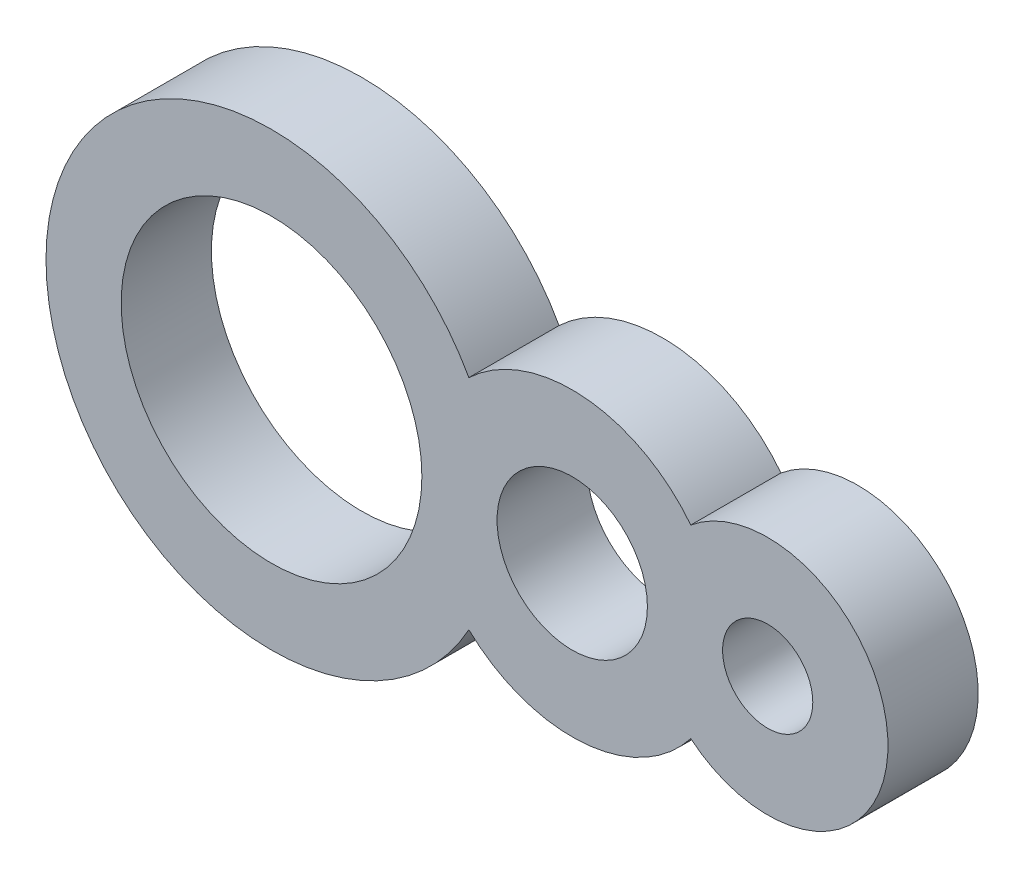
ISO-10303-21;
HEADER;
FILE_DESCRIPTION(('STEP AP214'),'2;1');
FILE_NAME('part.step','',(''),(''),'','','');
FILE_SCHEMA(('AUTOMOTIVE_DESIGN { 1 0 10303 214 1 1 1 1 }'));
ENDSEC;
DATA;
#1=APPLICATION_CONTEXT('core data for automotive mechanical design processes');
#2=APPLICATION_PROTOCOL_DEFINITION('international standard','automotive_design',2000,#1);
#3=PRODUCT_CONTEXT('',#1,'mechanical');
#4=PRODUCT('Part','Part','',(#3));
#5=PRODUCT_RELATED_PRODUCT_CATEGORY('part','',(#4));
#6=PRODUCT_DEFINITION_FORMATION('','',#4);
#7=PRODUCT_DEFINITION_CONTEXT('part definition',#1,'design');
#8=PRODUCT_DEFINITION('design','',#6,#7);
#9=PRODUCT_DEFINITION_SHAPE('','',#8);
#10=(LENGTH_UNIT() NAMED_UNIT(*) SI_UNIT(.MILLI.,.METRE.));
#11=(NAMED_UNIT(*) PLANE_ANGLE_UNIT() SI_UNIT($,.RADIAN.));
#12=(NAMED_UNIT(*) SI_UNIT($,.STERADIAN.) SOLID_ANGLE_UNIT());
#13=UNCERTAINTY_MEASURE_WITH_UNIT(LENGTH_MEASURE(1.E-05),#10,'distance_accuracy_value','');
#14=(GEOMETRIC_REPRESENTATION_CONTEXT(3) GLOBAL_UNCERTAINTY_ASSIGNED_CONTEXT((#13)) GLOBAL_UNIT_ASSIGNED_CONTEXT((#10,
#11,#12)) REPRESENTATION_CONTEXT('',''));
#15=CARTESIAN_POINT('',(0.,0.,0.));
#16=DIRECTION('',(0.,0.,1.));
#17=DIRECTION('',(1.,0.,0.));
#18=AXIS2_PLACEMENT_3D('',#15,#16,#17);
#19=CARTESIAN_POINT('',(13.25,0.,3.));
#20=DIRECTION('',(0.,0.,1.));
#21=DIRECTION('',(1.,0.,0.));
#22=AXIS2_PLACEMENT_3D('',#19,#20,#21);
#23=PLANE('',#22);
#24=CARTESIAN_POINT('',(10.,0.,3.));
#25=DIRECTION('',(0.,0.,1.));
#26=DIRECTION('',(1.,0.,0.));
#27=AXIS2_PLACEMENT_3D('',#24,#25,#26);
#28=CIRCLE('',#27,2.5);
#29=CARTESIAN_POINT('',(12.5,0.,3.));
#30=VERTEX_POINT('',#29);
#31=EDGE_CURVE('E134',#30,#30,#28,.T.);
#32=ORIENTED_EDGE('',*,*,#31,.F.);
#33=EDGE_LOOP('',(#32));
#34=FACE_BOUND('',#33,.T.);
#35=CARTESIAN_POINT('',(16.5,0.,3.));
#36=DIRECTION('',(0.,0.,1.));
#37=DIRECTION('',(1.,0.,0.));
#38=AXIS2_PLACEMENT_3D('',#35,#36,#37);
#39=CIRCLE('',#38,4.);
#40=CARTESIAN_POINT('',(13.9423076923077,-3.0754203060999,3.));
#41=VERTEX_POINT('',#40);
#42=CARTESIAN_POINT('',(13.9423076923077,3.0754203060999,3.));
#43=VERTEX_POINT('',#42);
#44=EDGE_CURVE('E92',#41,#43,#39,.T.);
#45=ORIENTED_EDGE('',*,*,#44,.T.);
#46=CARTESIAN_POINT('',(10.,0.,3.));
#47=DIRECTION('',(0.,0.,1.));
#48=DIRECTION('',(1.,0.,0.));
#49=AXIS2_PLACEMENT_3D('',#46,#47,#48);
#50=CIRCLE('',#49,5.);
#51=CARTESIAN_POINT('',(6.5625,3.63092188706945,3.));
#52=VERTEX_POINT('',#51);
#53=EDGE_CURVE('E87',#43,#52,#50,.T.);
#54=ORIENTED_EDGE('',*,*,#53,.T.);
#55=CARTESIAN_POINT('',(0.,0.,3.));
#56=DIRECTION('',(0.,0.,1.));
#57=DIRECTION('',(1.,0.,0.));
#58=AXIS2_PLACEMENT_3D('',#55,#56,#57);
#59=CIRCLE('',#58,7.5);
#60=CARTESIAN_POINT('',(6.5625,-3.63092188706945,3.));
#61=VERTEX_POINT('',#60);
#62=EDGE_CURVE('E90',#52,#61,#59,.T.);
#63=ORIENTED_EDGE('',*,*,#62,.T.);
#64=CARTESIAN_POINT('',(10.,0.,3.));
#65=DIRECTION('',(0.,0.,1.));
#66=DIRECTION('',(1.,0.,0.));
#67=AXIS2_PLACEMENT_3D('',#64,#65,#66);
#68=CIRCLE('',#67,5.);
#69=EDGE_CURVE('E57',#61,#41,#68,.T.);
#70=ORIENTED_EDGE('',*,*,#69,.T.);
#71=EDGE_LOOP('',(#45,#54,#63,#70));
#72=FACE_BOUND('',#71,.T.);
#73=CARTESIAN_POINT('',(0.,0.,3.));
#74=DIRECTION('',(0.,0.,1.));
#75=DIRECTION('',(1.,0.,0.));
#76=AXIS2_PLACEMENT_3D('',#73,#74,#75);
#77=CIRCLE('',#76,5.);
#78=CARTESIAN_POINT('',(5.,0.,3.));
#79=VERTEX_POINT('',#78);
#80=EDGE_CURVE('E112',#79,#79,#77,.T.);
#81=ORIENTED_EDGE('',*,*,#80,.F.);
#82=EDGE_LOOP('',(#81));
#83=FACE_BOUND('',#82,.T.);
#84=CARTESIAN_POINT('',(16.5,0.,3.));
#85=DIRECTION('',(0.,0.,1.));
#86=DIRECTION('',(1.,0.,0.));
#87=AXIS2_PLACEMENT_3D('',#84,#85,#86);
#88=CIRCLE('',#87,1.5);
#89=CARTESIAN_POINT('',(18.,0.,3.));
#90=VERTEX_POINT('',#89);
#91=EDGE_CURVE('E142',#90,#90,#88,.T.);
#92=ORIENTED_EDGE('',*,*,#91,.F.);
#93=EDGE_LOOP('',(#92));
#94=FACE_BOUND('',#93,.T.);
#95=ADVANCED_FACE('F39',(#34,#72,#83,#94),#23,.T.);
#96=CARTESIAN_POINT('',(13.25,0.,0.));
#97=DIRECTION('',(0.,0.,1.));
#98=DIRECTION('',(1.,0.,0.));
#99=AXIS2_PLACEMENT_3D('',#96,#97,#98);
#100=PLANE('',#99);
#101=CARTESIAN_POINT('',(16.5,0.,0.));
#102=DIRECTION('',(0.,0.,1.));
#103=DIRECTION('',(1.,0.,0.));
#104=AXIS2_PLACEMENT_3D('',#101,#102,#103);
#105=CIRCLE('',#104,4.);
#106=CARTESIAN_POINT('',(13.9423076923077,-3.0754203060999,0.));
#107=VERTEX_POINT('',#106);
#108=CARTESIAN_POINT('',(13.9423076923077,3.0754203060999,0.));
#109=VERTEX_POINT('',#108);
#110=EDGE_CURVE('E108',#107,#109,#105,.T.);
#111=ORIENTED_EDGE('',*,*,#110,.F.);
#112=CARTESIAN_POINT('',(10.,0.,0.));
#113=DIRECTION('',(0.,0.,1.));
#114=DIRECTION('',(1.,0.,0.));
#115=AXIS2_PLACEMENT_3D('',#112,#113,#114);
#116=CIRCLE('',#115,5.);
#117=CARTESIAN_POINT('',(6.5625,-3.63092188706945,0.));
#118=VERTEX_POINT('',#117);
#119=EDGE_CURVE('E80',#118,#107,#116,.T.);
#120=ORIENTED_EDGE('',*,*,#119,.F.);
#121=CARTESIAN_POINT('',(0.,0.,0.));
#122=DIRECTION('',(0.,0.,1.));
#123=DIRECTION('',(1.,0.,0.));
#124=AXIS2_PLACEMENT_3D('',#121,#122,#123);
#125=CIRCLE('',#124,7.5);
#126=CARTESIAN_POINT('',(6.5625,3.63092188706945,0.));
#127=VERTEX_POINT('',#126);
#128=EDGE_CURVE('E74',#127,#118,#125,.T.);
#129=ORIENTED_EDGE('',*,*,#128,.F.);
#130=CARTESIAN_POINT('',(10.,0.,0.));
#131=DIRECTION('',(0.,0.,1.));
#132=DIRECTION('',(1.,0.,0.));
#133=AXIS2_PLACEMENT_3D('',#130,#131,#132);
#134=CIRCLE('',#133,5.);
#135=EDGE_CURVE('E97',#109,#127,#134,.T.);
#136=ORIENTED_EDGE('',*,*,#135,.F.);
#137=EDGE_LOOP('',(#111,#120,#129,#136));
#138=FACE_BOUND('',#137,.T.);
#139=CARTESIAN_POINT('',(0.,0.,0.));
#140=DIRECTION('',(0.,0.,1.));
#141=DIRECTION('',(1.,0.,0.));
#142=AXIS2_PLACEMENT_3D('',#139,#140,#141);
#143=CIRCLE('',#142,5.);
#144=CARTESIAN_POINT('',(5.,0.,0.));
#145=VERTEX_POINT('',#144);
#146=EDGE_CURVE('E130',#145,#145,#143,.T.);
#147=ORIENTED_EDGE('',*,*,#146,.T.);
#148=EDGE_LOOP('',(#147));
#149=FACE_BOUND('',#148,.T.);
#150=CARTESIAN_POINT('',(10.,0.,0.));
#151=DIRECTION('',(0.,0.,1.));
#152=DIRECTION('',(1.,0.,0.));
#153=AXIS2_PLACEMENT_3D('',#150,#151,#152);
#154=CIRCLE('',#153,2.5);
#155=CARTESIAN_POINT('',(12.5,0.,0.));
#156=VERTEX_POINT('',#155);
#157=EDGE_CURVE('E138',#156,#156,#154,.T.);
#158=ORIENTED_EDGE('',*,*,#157,.T.);
#159=EDGE_LOOP('',(#158));
#160=FACE_BOUND('',#159,.T.);
#161=CARTESIAN_POINT('',(16.5,0.,0.));
#162=DIRECTION('',(0.,0.,1.));
#163=DIRECTION('',(1.,0.,0.));
#164=AXIS2_PLACEMENT_3D('',#161,#162,#163);
#165=CIRCLE('',#164,1.5);
#166=CARTESIAN_POINT('',(18.,0.,0.));
#167=VERTEX_POINT('',#166);
#168=EDGE_CURVE('E146',#167,#167,#165,.T.);
#169=ORIENTED_EDGE('',*,*,#168,.T.);
#170=EDGE_LOOP('',(#169));
#171=FACE_BOUND('',#170,.T.);
#172=ADVANCED_FACE('F125',(#138,#149,#160,#171),#100,.F.);
#173=CARTESIAN_POINT('',(16.5,0.,3.));
#174=DIRECTION('',(0.,0.,-1.));
#175=DIRECTION('',(-1.,0.,0.));
#176=AXIS2_PLACEMENT_3D('',#173,#174,#175);
#177=CYLINDRICAL_SURFACE('',#176,4.);
#178=ORIENTED_EDGE('',*,*,#110,.T.);
#179=DIRECTION('',(0.,0.,-1.));
#180=VECTOR('',#179,1.);
#181=CARTESIAN_POINT('',(13.9423076923077,3.0754203060999,3.));
#182=LINE('',#181,#180);
#183=EDGE_CURVE('E11',#43,#109,#182,.T.);
#184=ORIENTED_EDGE('',*,*,#183,.F.);
#185=ORIENTED_EDGE('',*,*,#44,.F.);
#186=DIRECTION('',(0.,0.,-1.));
#187=VECTOR('',#186,1.);
#188=CARTESIAN_POINT('',(13.9423076923077,-3.0754203060999,3.));
#189=LINE('',#188,#187);
#190=EDGE_CURVE('E104',#41,#107,#189,.T.);
#191=ORIENTED_EDGE('',*,*,#190,.T.);
#192=EDGE_LOOP('',(#178,#184,#185,#191));
#193=FACE_BOUND('',#192,.T.);
#194=ADVANCED_FACE('F41',(#193),#177,.T.);
#195=CARTESIAN_POINT('',(10.,0.,3.));
#196=DIRECTION('',(0.,0.,-1.));
#197=DIRECTION('',(-1.,0.,0.));
#198=AXIS2_PLACEMENT_3D('',#195,#196,#197);
#199=CYLINDRICAL_SURFACE('',#198,5.);
#200=ORIENTED_EDGE('',*,*,#135,.T.);
#201=DIRECTION('',(0.,0.,-1.));
#202=VECTOR('',#201,1.);
#203=CARTESIAN_POINT('',(6.5625,3.63092188706945,3.));
#204=LINE('',#203,#202);
#205=EDGE_CURVE('E49',#52,#127,#204,.T.);
#206=ORIENTED_EDGE('',*,*,#205,.F.);
#207=ORIENTED_EDGE('',*,*,#53,.F.);
#208=ORIENTED_EDGE('',*,*,#183,.T.);
#209=EDGE_LOOP('',(#200,#206,#207,#208));
#210=FACE_BOUND('',#209,.T.);
#211=ADVANCED_FACE('F96',(#210),#199,.T.);
#212=CARTESIAN_POINT('',(0.,0.,3.));
#213=DIRECTION('',(0.,0.,-1.));
#214=DIRECTION('',(-1.,0.,0.));
#215=AXIS2_PLACEMENT_3D('',#212,#213,#214);
#216=CYLINDRICAL_SURFACE('',#215,7.5);
#217=ORIENTED_EDGE('',*,*,#128,.T.);
#218=DIRECTION('',(0.,0.,-1.));
#219=VECTOR('',#218,1.);
#220=CARTESIAN_POINT('',(6.5625,-3.63092188706945,3.));
#221=LINE('',#220,#219);
#222=EDGE_CURVE('E99',#61,#118,#221,.T.);
#223=ORIENTED_EDGE('',*,*,#222,.F.);
#224=ORIENTED_EDGE('',*,*,#62,.F.);
#225=ORIENTED_EDGE('',*,*,#205,.T.);
#226=EDGE_LOOP('',(#217,#223,#224,#225));
#227=FACE_BOUND('',#226,.T.);
#228=ADVANCED_FACE('F100',(#227),#216,.T.);
#229=CARTESIAN_POINT('',(10.,0.,3.));
#230=DIRECTION('',(0.,0.,-1.));
#231=DIRECTION('',(-1.,0.,0.));
#232=AXIS2_PLACEMENT_3D('',#229,#230,#231);
#233=CYLINDRICAL_SURFACE('',#232,5.);
#234=ORIENTED_EDGE('',*,*,#119,.T.);
#235=ORIENTED_EDGE('',*,*,#190,.F.);
#236=ORIENTED_EDGE('',*,*,#69,.F.);
#237=ORIENTED_EDGE('',*,*,#222,.T.);
#238=EDGE_LOOP('',(#234,#235,#236,#237));
#239=FACE_BOUND('',#238,.T.);
#240=ADVANCED_FACE('F122',(#239),#233,.T.);
#241=CARTESIAN_POINT('',(0.,0.,3.));
#242=DIRECTION('',(0.,0.,-1.));
#243=DIRECTION('',(-1.,0.,0.));
#244=AXIS2_PLACEMENT_3D('',#241,#242,#243);
#245=CYLINDRICAL_SURFACE('',#244,5.);
#246=ORIENTED_EDGE('',*,*,#80,.T.);
#247=EDGE_LOOP('',(#246));
#248=FACE_BOUND('',#247,.T.);
#249=ORIENTED_EDGE('',*,*,#146,.F.);
#250=EDGE_LOOP('',(#249));
#251=FACE_BOUND('',#250,.T.);
#252=ADVANCED_FACE('F166',(#248,#251),#245,.F.);
#253=CARTESIAN_POINT('',(10.,0.,3.));
#254=DIRECTION('',(0.,0.,-1.));
#255=DIRECTION('',(-1.,0.,0.));
#256=AXIS2_PLACEMENT_3D('',#253,#254,#255);
#257=CYLINDRICAL_SURFACE('',#256,2.5);
#258=ORIENTED_EDGE('',*,*,#31,.T.);
#259=EDGE_LOOP('',(#258));
#260=FACE_BOUND('',#259,.T.);
#261=ORIENTED_EDGE('',*,*,#157,.F.);
#262=EDGE_LOOP('',(#261));
#263=FACE_BOUND('',#262,.T.);
#264=ADVANCED_FACE('F212',(#260,#263),#257,.F.);
#265=CARTESIAN_POINT('',(16.5,0.,3.));
#266=DIRECTION('',(0.,0.,-1.));
#267=DIRECTION('',(-1.,0.,0.));
#268=AXIS2_PLACEMENT_3D('',#265,#266,#267);
#269=CYLINDRICAL_SURFACE('',#268,1.5);
#270=ORIENTED_EDGE('',*,*,#91,.T.);
#271=EDGE_LOOP('',(#270));
#272=FACE_BOUND('',#271,.T.);
#273=ORIENTED_EDGE('',*,*,#168,.F.);
#274=EDGE_LOOP('',(#273));
#275=FACE_BOUND('',#274,.T.);
#276=ADVANCED_FACE('F154',(#272,#275),#269,.F.);
#277=CLOSED_SHELL('',(#95,#172,#194,#211,#228,#240,#252,#264,#276));
#278=MANIFOLD_SOLID_BREP('B2',#277);
#279=ADVANCED_BREP_SHAPE_REPRESENTATION('',(#18,#278),#14);
#280=SHAPE_DEFINITION_REPRESENTATION(#9,#279);
ENDSEC;
END-ISO-10303-21;
